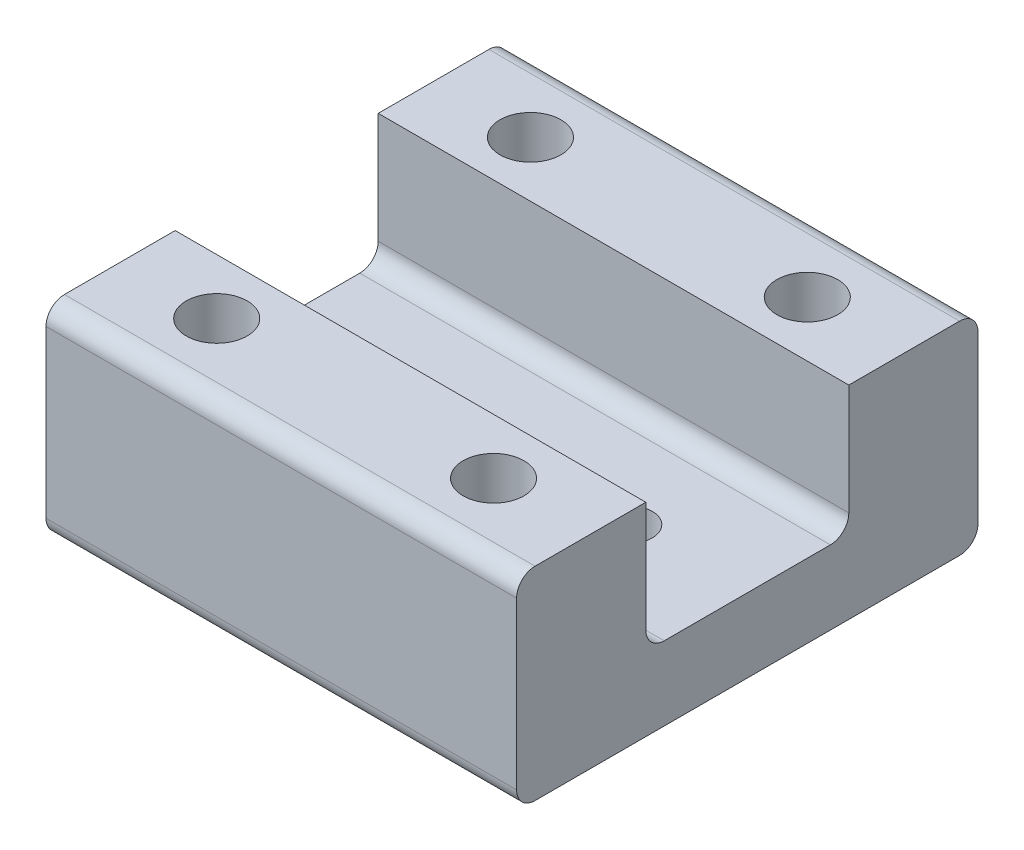
ISO-10303-21;
HEADER;
FILE_DESCRIPTION(('STEP AP214'),'2;1');
FILE_NAME('part.step','',(''),(''),'','','');
FILE_SCHEMA(('AUTOMOTIVE_DESIGN { 1 0 10303 214 1 1 1 1 }'));
ENDSEC;
DATA;
#1=APPLICATION_CONTEXT('core data for automotive mechanical design processes');
#2=APPLICATION_PROTOCOL_DEFINITION('international standard','automotive_design',2000,#1);
#3=PRODUCT_CONTEXT('',#1,'mechanical');
#4=PRODUCT('Part','Part','',(#3));
#5=PRODUCT_RELATED_PRODUCT_CATEGORY('part','',(#4));
#6=PRODUCT_DEFINITION_FORMATION('','',#4);
#7=PRODUCT_DEFINITION_CONTEXT('part definition',#1,'design');
#8=PRODUCT_DEFINITION('design','',#6,#7);
#9=PRODUCT_DEFINITION_SHAPE('','',#8);
#10=(LENGTH_UNIT() NAMED_UNIT(*) SI_UNIT(.MILLI.,.METRE.));
#11=(NAMED_UNIT(*) PLANE_ANGLE_UNIT() SI_UNIT($,.RADIAN.));
#12=(NAMED_UNIT(*) SI_UNIT($,.STERADIAN.) SOLID_ANGLE_UNIT());
#13=UNCERTAINTY_MEASURE_WITH_UNIT(LENGTH_MEASURE(1.E-05),#10,'distance_accuracy_value','');
#14=(GEOMETRIC_REPRESENTATION_CONTEXT(3) GLOBAL_UNCERTAINTY_ASSIGNED_CONTEXT((#13)) GLOBAL_UNIT_ASSIGNED_CONTEXT((#10,
#11,#12)) REPRESENTATION_CONTEXT('',''));
#15=CARTESIAN_POINT('',(0.,0.,0.));
#16=DIRECTION('',(0.,0.,1.));
#17=DIRECTION('',(1.,0.,0.));
#18=AXIS2_PLACEMENT_3D('',#15,#16,#17);
#19=CARTESIAN_POINT('',(0.,11.,0.));
#20=DIRECTION('',(0.,1.,0.));
#21=DIRECTION('',(0.,0.,1.));
#22=AXIS2_PLACEMENT_3D('',#19,#20,#21);
#23=PLANE('',#22);
#24=DIRECTION('',(0.,0.,1.));
#25=VECTOR('',#24,1.);
#26=CARTESIAN_POINT('',(-12.75,11.,12.5));
#27=LINE('',#26,#25);
#28=CARTESIAN_POINT('',(-12.75,11.,5.50000000000001));
#29=VERTEX_POINT('',#28);
#30=CARTESIAN_POINT('',(-12.75,11.,11.5));
#31=VERTEX_POINT('',#30);
#32=EDGE_CURVE('E168',#29,#31,#27,.T.);
#33=ORIENTED_EDGE('',*,*,#32,.T.);
#34=DIRECTION('',(1.,0.,0.));
#35=VECTOR('',#34,1.);
#36=CARTESIAN_POINT('',(12.75,11.,11.5));
#37=LINE('',#36,#35);
#38=CARTESIAN_POINT('',(12.75,11.,11.5));
#39=VERTEX_POINT('',#38);
#40=EDGE_CURVE('E153',#31,#39,#37,.T.);
#41=ORIENTED_EDGE('',*,*,#40,.T.);
#42=DIRECTION('',(0.,0.,-1.));
#43=VECTOR('',#42,1.);
#44=CARTESIAN_POINT('',(12.75,11.,12.5));
#45=LINE('',#44,#43);
#46=CARTESIAN_POINT('',(12.75,11.,5.5));
#47=VERTEX_POINT('',#46);
#48=EDGE_CURVE('E146',#39,#47,#45,.T.);
#49=ORIENTED_EDGE('',*,*,#48,.T.);
#50=DIRECTION('',(-1.,0.,0.));
#51=VECTOR('',#50,1.);
#52=CARTESIAN_POINT('',(12.75,11.,5.5));
#53=LINE('',#52,#51);
#54=EDGE_CURVE('E150',#47,#29,#53,.T.);
#55=ORIENTED_EDGE('',*,*,#54,.T.);
#56=EDGE_LOOP('',(#33,#41,#49,#55));
#57=FACE_BOUND('',#56,.T.);
#58=CARTESIAN_POINT('',(-7.50000000000012,11.,8.5));
#59=DIRECTION('',(0.,-1.,0.));
#60=DIRECTION('',(0.,0.,-1.));
#61=AXIS2_PLACEMENT_3D('',#58,#59,#60);
#62=CIRCLE('',#61,1.64999999999999);
#63=CARTESIAN_POINT('',(-7.50000000000012,11.,6.85000000000001));
#64=VERTEX_POINT('',#63);
#65=EDGE_CURVE('E423',#64,#64,#62,.T.);
#66=ORIENTED_EDGE('',*,*,#65,.T.);
#67=EDGE_LOOP('',(#66));
#68=FACE_BOUND('',#67,.T.);
#69=CARTESIAN_POINT('',(7.49999999999987,11.,8.5));
#70=DIRECTION('',(0.,-1.,0.));
#71=DIRECTION('',(0.,0.,-1.));
#72=AXIS2_PLACEMENT_3D('',#69,#70,#71);
#73=CIRCLE('',#72,1.64999999999999);
#74=CARTESIAN_POINT('',(7.49999999999987,11.,6.85000000000002));
#75=VERTEX_POINT('',#74);
#76=EDGE_CURVE('E431',#75,#75,#73,.T.);
#77=ORIENTED_EDGE('',*,*,#76,.T.);
#78=EDGE_LOOP('',(#77));
#79=FACE_BOUND('',#78,.T.);
#80=ADVANCED_FACE('F44',(#57,#68,#79),#23,.T.);
#81=CARTESIAN_POINT('',(0.,4.,0.));
#82=DIRECTION('',(0.,-1.,0.));
#83=DIRECTION('',(0.,0.,-1.));
#84=AXIS2_PLACEMENT_3D('',#81,#82,#83);
#85=PLANE('',#84);
#86=CARTESIAN_POINT('',(6.34999999999999,4.,0.));
#87=DIRECTION('',(0.,-1.,0.));
#88=DIRECTION('',(0.,0.,-1.));
#89=AXIS2_PLACEMENT_3D('',#86,#87,#88);
#90=CIRCLE('',#89,1.25);
#91=CARTESIAN_POINT('',(6.34999999999999,4.,-1.25));
#92=VERTEX_POINT('',#91);
#93=EDGE_CURVE('E399',#92,#92,#90,.T.);
#94=ORIENTED_EDGE('',*,*,#93,.T.);
#95=EDGE_LOOP('',(#94));
#96=FACE_BOUND('',#95,.T.);
#97=CARTESIAN_POINT('',(-6.35000000000001,4.,0.));
#98=DIRECTION('',(0.,-1.,0.));
#99=DIRECTION('',(0.,0.,-1.));
#100=AXIS2_PLACEMENT_3D('',#97,#98,#99);
#101=CIRCLE('',#100,1.25);
#102=CARTESIAN_POINT('',(-6.35000000000001,4.,-1.25));
#103=VERTEX_POINT('',#102);
#104=EDGE_CURVE('E156',#103,#103,#101,.T.);
#105=ORIENTED_EDGE('',*,*,#104,.T.);
#106=EDGE_LOOP('',(#105));
#107=FACE_BOUND('',#106,.T.);
#108=DIRECTION('',(0.,0.,-1.));
#109=VECTOR('',#108,1.);
#110=CARTESIAN_POINT('',(12.75,4.,12.5));
#111=LINE('',#110,#109);
#112=CARTESIAN_POINT('',(12.75,4.,4.5));
#113=VERTEX_POINT('',#112);
#114=CARTESIAN_POINT('',(12.75,4.,-4.5));
#115=VERTEX_POINT('',#114);
#116=EDGE_CURVE('E201',#113,#115,#111,.T.);
#117=ORIENTED_EDGE('',*,*,#116,.T.);
#118=DIRECTION('',(1.,0.,0.));
#119=VECTOR('',#118,1.);
#120=CARTESIAN_POINT('',(-12.75,4.,-4.5));
#121=LINE('',#120,#119);
#122=CARTESIAN_POINT('',(-12.75,4.,-4.50000000000001));
#123=VERTEX_POINT('',#122);
#124=EDGE_CURVE('E276',#115,#123,#121,.F.);
#125=ORIENTED_EDGE('',*,*,#124,.T.);
#126=DIRECTION('',(0.,0.,1.));
#127=VECTOR('',#126,1.);
#128=CARTESIAN_POINT('',(-12.75,4.,12.5));
#129=LINE('',#128,#127);
#130=CARTESIAN_POINT('',(-12.75,4.,4.50000000000001));
#131=VERTEX_POINT('',#130);
#132=EDGE_CURVE('E205',#123,#131,#129,.T.);
#133=ORIENTED_EDGE('',*,*,#132,.T.);
#134=DIRECTION('',(-1.,0.,0.));
#135=VECTOR('',#134,1.);
#136=CARTESIAN_POINT('',(12.75,4.,4.5));
#137=LINE('',#136,#135);
#138=EDGE_CURVE('E273',#131,#113,#137,.F.);
#139=ORIENTED_EDGE('',*,*,#138,.T.);
#140=EDGE_LOOP('',(#117,#125,#133,#139));
#141=FACE_BOUND('',#140,.T.);
#142=ADVANCED_FACE('F305',(#96,#107,#141),#85,.F.);
#143=CARTESIAN_POINT('',(12.75,4.,12.5));
#144=DIRECTION('',(-1.,0.,0.));
#145=DIRECTION('',(0.,0.,1.));
#146=AXIS2_PLACEMENT_3D('',#143,#144,#145);
#147=PLANE('',#146);
#148=DIRECTION('',(0.,0.,-1.));
#149=VECTOR('',#148,1.);
#150=CARTESIAN_POINT('',(12.75,0.,12.5));
#151=LINE('',#150,#149);
#152=CARTESIAN_POINT('',(12.75,0.,11.5));
#153=VERTEX_POINT('',#152);
#154=CARTESIAN_POINT('',(12.75,0.,-11.5));
#155=VERTEX_POINT('',#154);
#156=EDGE_CURVE('E200',#153,#155,#151,.T.);
#157=ORIENTED_EDGE('',*,*,#156,.T.);
#158=CARTESIAN_POINT('',(12.75,1.,-11.5));
#159=DIRECTION('',(-1.,0.,0.));
#160=DIRECTION('',(0.,0.,1.));
#161=AXIS2_PLACEMENT_3D('',#158,#159,#160);
#162=CIRCLE('',#161,1.);
#163=CARTESIAN_POINT('',(12.75,1.,-12.5));
#164=VERTEX_POINT('',#163);
#165=EDGE_CURVE('E262',#155,#164,#162,.F.);
#166=ORIENTED_EDGE('',*,*,#165,.T.);
#167=DIRECTION('',(0.,-1.,0.));
#168=VECTOR('',#167,1.);
#169=CARTESIAN_POINT('',(12.75,4.,-12.5));
#170=LINE('',#169,#168);
#171=CARTESIAN_POINT('',(12.75,10.,-12.5));
#172=VERTEX_POINT('',#171);
#173=EDGE_CURVE('E226',#172,#164,#170,.T.);
#174=ORIENTED_EDGE('',*,*,#173,.F.);
#175=CARTESIAN_POINT('',(12.75,10.,-11.5));
#176=DIRECTION('',(-1.,0.,0.));
#177=DIRECTION('',(0.,0.,1.));
#178=AXIS2_PLACEMENT_3D('',#175,#176,#177);
#179=CIRCLE('',#178,1.);
#180=CARTESIAN_POINT('',(12.75,11.,-11.5));
#181=VERTEX_POINT('',#180);
#182=EDGE_CURVE('E259',#172,#181,#179,.F.);
#183=ORIENTED_EDGE('',*,*,#182,.T.);
#184=DIRECTION('',(0.,0.,-1.));
#185=VECTOR('',#184,1.);
#186=CARTESIAN_POINT('',(12.75,11.,-12.5));
#187=LINE('',#186,#185);
#188=CARTESIAN_POINT('',(12.75,11.,-5.5));
#189=VERTEX_POINT('',#188);
#190=EDGE_CURVE('E175',#189,#181,#187,.T.);
#191=ORIENTED_EDGE('',*,*,#190,.F.);
#192=DIRECTION('',(0.,-1.,0.));
#193=VECTOR('',#192,1.);
#194=CARTESIAN_POINT('',(12.75,11.,-5.5));
#195=LINE('',#194,#193);
#196=CARTESIAN_POINT('',(12.75,5.,-5.5));
#197=VERTEX_POINT('',#196);
#198=EDGE_CURVE('E192',#189,#197,#195,.T.);
#199=ORIENTED_EDGE('',*,*,#198,.T.);
#200=CARTESIAN_POINT('',(12.75,5.,-4.5));
#201=DIRECTION('',(-1.,0.,0.));
#202=DIRECTION('',(0.,0.,1.));
#203=AXIS2_PLACEMENT_3D('',#200,#201,#202);
#204=CIRCLE('',#203,1.);
#205=EDGE_CURVE('E290',#197,#115,#204,.T.);
#206=ORIENTED_EDGE('',*,*,#205,.T.);
#207=ORIENTED_EDGE('',*,*,#116,.F.);
#208=CARTESIAN_POINT('',(12.75,5.,4.5));
#209=DIRECTION('',(-1.,0.,0.));
#210=DIRECTION('',(0.,0.,1.));
#211=AXIS2_PLACEMENT_3D('',#208,#209,#210);
#212=CIRCLE('',#211,1.);
#213=CARTESIAN_POINT('',(12.75,5.,5.5));
#214=VERTEX_POINT('',#213);
#215=EDGE_CURVE('E11',#113,#214,#212,.T.);
#216=ORIENTED_EDGE('',*,*,#215,.T.);
#217=DIRECTION('',(0.,-1.,0.));
#218=VECTOR('',#217,1.);
#219=CARTESIAN_POINT('',(12.75,11.,5.5));
#220=LINE('',#219,#218);
#221=EDGE_CURVE('E162',#47,#214,#220,.T.);
#222=ORIENTED_EDGE('',*,*,#221,.F.);
#223=ORIENTED_EDGE('',*,*,#48,.F.);
#224=CARTESIAN_POINT('',(12.75,10.,11.5));
#225=DIRECTION('',(-1.,0.,0.));
#226=DIRECTION('',(0.,0.,1.));
#227=AXIS2_PLACEMENT_3D('',#224,#225,#226);
#228=CIRCLE('',#227,1.);
#229=CARTESIAN_POINT('',(12.75,10.,12.5));
#230=VERTEX_POINT('',#229);
#231=EDGE_CURVE('E68',#39,#230,#228,.F.);
#232=ORIENTED_EDGE('',*,*,#231,.T.);
#233=DIRECTION('',(0.,-1.,0.));
#234=VECTOR('',#233,1.);
#235=CARTESIAN_POINT('',(12.75,4.,12.5));
#236=LINE('',#235,#234);
#237=CARTESIAN_POINT('',(12.75,1.,12.5));
#238=VERTEX_POINT('',#237);
#239=EDGE_CURVE('E210',#230,#238,#236,.T.);
#240=ORIENTED_EDGE('',*,*,#239,.T.);
#241=CARTESIAN_POINT('',(12.75,1.,11.5));
#242=DIRECTION('',(-1.,0.,0.));
#243=DIRECTION('',(0.,0.,1.));
#244=AXIS2_PLACEMENT_3D('',#241,#242,#243);
#245=CIRCLE('',#244,1.);
#246=EDGE_CURVE('E60',#238,#153,#245,.F.);
#247=ORIENTED_EDGE('',*,*,#246,.T.);
#248=EDGE_LOOP('',(#157,#166,#174,#183,#191,#199,#206,#207,#216,#222,#223,#232,#240,#247));
#249=FACE_BOUND('',#248,.T.);
#250=ADVANCED_FACE('F171',(#249),#147,.F.);
#251=CARTESIAN_POINT('',(-12.75,4.,-12.5));
#252=DIRECTION('',(0.,0.,1.));
#253=DIRECTION('',(1.,0.,0.));
#254=AXIS2_PLACEMENT_3D('',#251,#252,#253);
#255=PLANE('',#254);
#256=ORIENTED_EDGE('',*,*,#173,.T.);
#257=DIRECTION('',(-1.,0.,0.));
#258=VECTOR('',#257,1.);
#259=CARTESIAN_POINT('',(-12.75,1.,-12.5));
#260=LINE('',#259,#258);
#261=CARTESIAN_POINT('',(-12.75,1.,-12.5));
#262=VERTEX_POINT('',#261);
#263=EDGE_CURVE('E233',#164,#262,#260,.T.);
#264=ORIENTED_EDGE('',*,*,#263,.T.);
#265=DIRECTION('',(0.,-1.,0.));
#266=VECTOR('',#265,1.);
#267=CARTESIAN_POINT('',(-12.75,4.,-12.5));
#268=LINE('',#267,#266);
#269=CARTESIAN_POINT('',(-12.75,10.,-12.5));
#270=VERTEX_POINT('',#269);
#271=EDGE_CURVE('E222',#270,#262,#268,.T.);
#272=ORIENTED_EDGE('',*,*,#271,.F.);
#273=DIRECTION('',(-1.,0.,0.));
#274=VECTOR('',#273,1.);
#275=CARTESIAN_POINT('',(-12.75,10.,-12.5));
#276=LINE('',#275,#274);
#277=EDGE_CURVE('E230',#270,#172,#276,.F.);
#278=ORIENTED_EDGE('',*,*,#277,.T.);
#279=EDGE_LOOP('',(#256,#264,#272,#278));
#280=FACE_BOUND('',#279,.T.);
#281=ADVANCED_FACE('F351',(#280),#255,.F.);
#282=CARTESIAN_POINT('',(-12.75,4.,12.5));
#283=DIRECTION('',(1.,0.,0.));
#284=DIRECTION('',(0.,0.,-1.));
#285=AXIS2_PLACEMENT_3D('',#282,#283,#284);
#286=PLANE('',#285);
#287=ORIENTED_EDGE('',*,*,#271,.T.);
#288=CARTESIAN_POINT('',(-12.75,1.,-11.5));
#289=DIRECTION('',(1.,0.,0.));
#290=DIRECTION('',(0.,0.,-1.));
#291=AXIS2_PLACEMENT_3D('',#288,#289,#290);
#292=CIRCLE('',#291,1.);
#293=CARTESIAN_POINT('',(-12.75,0.,-11.5));
#294=VERTEX_POINT('',#293);
#295=EDGE_CURVE('E246',#262,#294,#292,.F.);
#296=ORIENTED_EDGE('',*,*,#295,.T.);
#297=DIRECTION('',(0.,0.,1.));
#298=VECTOR('',#297,1.);
#299=CARTESIAN_POINT('',(-12.75,0.,12.5));
#300=LINE('',#299,#298);
#301=CARTESIAN_POINT('',(-12.75,0.,11.5));
#302=VERTEX_POINT('',#301);
#303=EDGE_CURVE('E206',#294,#302,#300,.T.);
#304=ORIENTED_EDGE('',*,*,#303,.T.);
#305=CARTESIAN_POINT('',(-12.75,1.,11.5));
#306=DIRECTION('',(1.,0.,0.));
#307=DIRECTION('',(0.,0.,-1.));
#308=AXIS2_PLACEMENT_3D('',#305,#306,#307);
#309=CIRCLE('',#308,1.);
#310=CARTESIAN_POINT('',(-12.75,1.,12.5));
#311=VERTEX_POINT('',#310);
#312=EDGE_CURVE('E237',#302,#311,#309,.F.);
#313=ORIENTED_EDGE('',*,*,#312,.T.);
#314=DIRECTION('',(0.,-1.,0.));
#315=VECTOR('',#314,1.);
#316=CARTESIAN_POINT('',(-12.75,4.,12.5));
#317=LINE('',#316,#315);
#318=CARTESIAN_POINT('',(-12.75,10.,12.5));
#319=VERTEX_POINT('',#318);
#320=EDGE_CURVE('E218',#319,#311,#317,.T.);
#321=ORIENTED_EDGE('',*,*,#320,.F.);
#322=CARTESIAN_POINT('',(-12.75,10.,11.5));
#323=DIRECTION('',(1.,0.,0.));
#324=DIRECTION('',(0.,0.,-1.));
#325=AXIS2_PLACEMENT_3D('',#322,#323,#324);
#326=CIRCLE('',#325,1.);
#327=EDGE_CURVE('E240',#319,#31,#326,.F.);
#328=ORIENTED_EDGE('',*,*,#327,.T.);
#329=ORIENTED_EDGE('',*,*,#32,.F.);
#330=DIRECTION('',(0.,-1.,0.));
#331=VECTOR('',#330,1.);
#332=CARTESIAN_POINT('',(-12.75,11.,5.50000000000001));
#333=LINE('',#332,#331);
#334=CARTESIAN_POINT('',(-12.75,5.,5.50000000000001));
#335=VERTEX_POINT('',#334);
#336=EDGE_CURVE('E165',#29,#335,#333,.T.);
#337=ORIENTED_EDGE('',*,*,#336,.T.);
#338=CARTESIAN_POINT('',(-12.75,5.,4.5));
#339=DIRECTION('',(1.,0.,0.));
#340=DIRECTION('',(0.,0.,-1.));
#341=AXIS2_PLACEMENT_3D('',#338,#339,#340);
#342=CIRCLE('',#341,1.);
#343=EDGE_CURVE('E53',#335,#131,#342,.T.);
#344=ORIENTED_EDGE('',*,*,#343,.T.);
#345=ORIENTED_EDGE('',*,*,#132,.F.);
#346=CARTESIAN_POINT('',(-12.75,5.,-4.5));
#347=DIRECTION('',(1.,0.,0.));
#348=DIRECTION('',(0.,0.,-1.));
#349=AXIS2_PLACEMENT_3D('',#346,#347,#348);
#350=CIRCLE('',#349,1.);
#351=CARTESIAN_POINT('',(-12.75,5.,-5.50000000000001));
#352=VERTEX_POINT('',#351);
#353=EDGE_CURVE('E293',#123,#352,#350,.T.);
#354=ORIENTED_EDGE('',*,*,#353,.T.);
#355=DIRECTION('',(0.,-1.,0.));
#356=VECTOR('',#355,1.);
#357=CARTESIAN_POINT('',(-12.75,11.,-5.50000000000001));
#358=LINE('',#357,#356);
#359=CARTESIAN_POINT('',(-12.75,11.,-5.50000000000001));
#360=VERTEX_POINT('',#359);
#361=EDGE_CURVE('E196',#360,#352,#358,.T.);
#362=ORIENTED_EDGE('',*,*,#361,.F.);
#363=DIRECTION('',(0.,0.,1.));
#364=VECTOR('',#363,1.);
#365=CARTESIAN_POINT('',(-12.75,11.,-12.5));
#366=LINE('',#365,#364);
#367=CARTESIAN_POINT('',(-12.75,11.,-11.5));
#368=VERTEX_POINT('',#367);
#369=EDGE_CURVE('E182',#368,#360,#366,.T.);
#370=ORIENTED_EDGE('',*,*,#369,.F.);
#371=CARTESIAN_POINT('',(-12.75,10.,-11.5));
#372=DIRECTION('',(1.,0.,0.));
#373=DIRECTION('',(0.,0.,-1.));
#374=AXIS2_PLACEMENT_3D('',#371,#372,#373);
#375=CIRCLE('',#374,1.);
#376=EDGE_CURVE('E243',#368,#270,#375,.F.);
#377=ORIENTED_EDGE('',*,*,#376,.T.);
#378=EDGE_LOOP('',(#287,#296,#304,#313,#321,#328,#329,#337,#344,#345,#354,#362,#370,#377));
#379=FACE_BOUND('',#378,.T.);
#380=ADVANCED_FACE('F300',(#379),#286,.F.);
#381=CARTESIAN_POINT('',(-12.75,4.,12.5));
#382=DIRECTION('',(0.,0.,-1.));
#383=DIRECTION('',(-1.,0.,0.));
#384=AXIS2_PLACEMENT_3D('',#381,#382,#383);
#385=PLANE('',#384);
#386=ORIENTED_EDGE('',*,*,#239,.F.);
#387=DIRECTION('',(1.,0.,0.));
#388=VECTOR('',#387,1.);
#389=CARTESIAN_POINT('',(-12.75,10.,12.5));
#390=LINE('',#389,#388);
#391=EDGE_CURVE('E287',#230,#319,#390,.F.);
#392=ORIENTED_EDGE('',*,*,#391,.T.);
#393=ORIENTED_EDGE('',*,*,#320,.T.);
#394=DIRECTION('',(1.,0.,0.));
#395=VECTOR('',#394,1.);
#396=CARTESIAN_POINT('',(12.75,1.,12.5));
#397=LINE('',#396,#395);
#398=EDGE_CURVE('E284',#311,#238,#397,.T.);
#399=ORIENTED_EDGE('',*,*,#398,.T.);
#400=EDGE_LOOP('',(#386,#392,#393,#399));
#401=FACE_BOUND('',#400,.T.);
#402=ADVANCED_FACE('F344',(#401),#385,.F.);
#403=CARTESIAN_POINT('',(0.,0.,0.));
#404=DIRECTION('',(0.,-1.,0.));
#405=DIRECTION('',(0.,0.,-1.));
#406=AXIS2_PLACEMENT_3D('',#403,#404,#405);
#407=PLANE('',#406);
#408=CARTESIAN_POINT('',(7.49999999999987,0.,8.5));
#409=DIRECTION('',(0.,-1.,0.));
#410=DIRECTION('',(0.,0.,-1.));
#411=AXIS2_PLACEMENT_3D('',#408,#409,#410);
#412=CIRCLE('',#411,1.64999999999999);
#413=CARTESIAN_POINT('',(7.49999999999987,0.,6.85000000000001));
#414=VERTEX_POINT('',#413);
#415=EDGE_CURVE('E435',#414,#414,#412,.T.);
#416=ORIENTED_EDGE('',*,*,#415,.F.);
#417=EDGE_LOOP('',(#416));
#418=FACE_BOUND('',#417,.T.);
#419=CARTESIAN_POINT('',(-7.50000000000012,0.,8.5));
#420=DIRECTION('',(0.,-1.,0.));
#421=DIRECTION('',(0.,0.,-1.));
#422=AXIS2_PLACEMENT_3D('',#419,#420,#421);
#423=CIRCLE('',#422,1.64999999999999);
#424=CARTESIAN_POINT('',(-7.50000000000012,0.,6.85000000000001));
#425=VERTEX_POINT('',#424);
#426=EDGE_CURVE('E427',#425,#425,#423,.T.);
#427=ORIENTED_EDGE('',*,*,#426,.F.);
#428=EDGE_LOOP('',(#427));
#429=FACE_BOUND('',#428,.T.);
#430=CARTESIAN_POINT('',(-7.50000000000012,0.,-8.5));
#431=DIRECTION('',(0.,-1.,0.));
#432=DIRECTION('',(0.,0.,-1.));
#433=AXIS2_PLACEMENT_3D('',#430,#431,#432);
#434=CIRCLE('',#433,1.64999999999999);
#435=CARTESIAN_POINT('',(-7.50000000000012,0.,-10.15));
#436=VERTEX_POINT('',#435);
#437=EDGE_CURVE('E419',#436,#436,#434,.T.);
#438=ORIENTED_EDGE('',*,*,#437,.F.);
#439=EDGE_LOOP('',(#438));
#440=FACE_BOUND('',#439,.T.);
#441=CARTESIAN_POINT('',(7.49999999999988,0.,-8.5));
#442=DIRECTION('',(0.,-1.,0.));
#443=DIRECTION('',(0.,0.,-1.));
#444=AXIS2_PLACEMENT_3D('',#441,#442,#443);
#445=CIRCLE('',#444,1.64999999999999);
#446=CARTESIAN_POINT('',(7.49999999999988,0.,-10.15));
#447=VERTEX_POINT('',#446);
#448=EDGE_CURVE('E411',#447,#447,#445,.T.);
#449=ORIENTED_EDGE('',*,*,#448,.F.);
#450=EDGE_LOOP('',(#449));
#451=FACE_BOUND('',#450,.T.);
#452=CARTESIAN_POINT('',(6.34999999999999,0.,0.));
#453=DIRECTION('',(0.,-1.,0.));
#454=DIRECTION('',(0.,0.,-1.));
#455=AXIS2_PLACEMENT_3D('',#452,#453,#454);
#456=CIRCLE('',#455,1.25);
#457=CARTESIAN_POINT('',(6.34999999999999,0.,-1.25));
#458=VERTEX_POINT('',#457);
#459=EDGE_CURVE('E403',#458,#458,#456,.T.);
#460=ORIENTED_EDGE('',*,*,#459,.F.);
#461=EDGE_LOOP('',(#460));
#462=FACE_BOUND('',#461,.T.);
#463=CARTESIAN_POINT('',(-6.35000000000001,0.,0.));
#464=DIRECTION('',(0.,-1.,0.));
#465=DIRECTION('',(0.,0.,-1.));
#466=AXIS2_PLACEMENT_3D('',#463,#464,#465);
#467=CIRCLE('',#466,1.25);
#468=CARTESIAN_POINT('',(-6.35000000000001,0.,-1.25));
#469=VERTEX_POINT('',#468);
#470=EDGE_CURVE('E395',#469,#469,#467,.T.);
#471=ORIENTED_EDGE('',*,*,#470,.F.);
#472=EDGE_LOOP('',(#471));
#473=FACE_BOUND('',#472,.T.);
#474=ORIENTED_EDGE('',*,*,#303,.F.);
#475=DIRECTION('',(-1.,0.,0.));
#476=VECTOR('',#475,1.);
#477=CARTESIAN_POINT('',(12.75,0.,-11.5));
#478=LINE('',#477,#476);
#479=EDGE_CURVE('E252',#294,#155,#478,.F.);
#480=ORIENTED_EDGE('',*,*,#479,.T.);
#481=ORIENTED_EDGE('',*,*,#156,.F.);
#482=DIRECTION('',(1.,0.,0.));
#483=VECTOR('',#482,1.);
#484=CARTESIAN_POINT('',(-12.75,0.,11.5));
#485=LINE('',#484,#483);
#486=EDGE_CURVE('E249',#153,#302,#485,.F.);
#487=ORIENTED_EDGE('',*,*,#486,.T.);
#488=EDGE_LOOP('',(#474,#480,#481,#487));
#489=FACE_BOUND('',#488,.T.);
#490=ADVANCED_FACE('F339',(#418,#429,#440,#451,#462,#473,#489),#407,.T.);
#491=CARTESIAN_POINT('',(12.75,11.,-5.5));
#492=DIRECTION('',(0.,0.,-1.));
#493=DIRECTION('',(-1.,0.,0.));
#494=AXIS2_PLACEMENT_3D('',#491,#492,#493);
#495=PLANE('',#494);
#496=ORIENTED_EDGE('',*,*,#361,.T.);
#497=DIRECTION('',(1.,0.,0.));
#498=VECTOR('',#497,1.);
#499=CARTESIAN_POINT('',(12.75,5.,-5.5));
#500=LINE('',#499,#498);
#501=EDGE_CURVE('E269',#352,#197,#500,.T.);
#502=ORIENTED_EDGE('',*,*,#501,.T.);
#503=ORIENTED_EDGE('',*,*,#198,.F.);
#504=DIRECTION('',(1.,0.,0.));
#505=VECTOR('',#504,1.);
#506=CARTESIAN_POINT('',(12.75,11.,-5.5));
#507=LINE('',#506,#505);
#508=EDGE_CURVE('E189',#360,#189,#507,.T.);
#509=ORIENTED_EDGE('',*,*,#508,.F.);
#510=EDGE_LOOP('',(#496,#502,#503,#509));
#511=FACE_BOUND('',#510,.T.);
#512=ADVANCED_FACE('F336',(#511),#495,.F.);
#513=CARTESIAN_POINT('',(0.,11.,0.));
#514=DIRECTION('',(0.,-1.,0.));
#515=DIRECTION('',(0.,0.,-1.));
#516=AXIS2_PLACEMENT_3D('',#513,#514,#515);
#517=PLANE('',#516);
#518=CARTESIAN_POINT('',(-7.50000000000012,11.,-8.5));
#519=DIRECTION('',(0.,-1.,0.));
#520=DIRECTION('',(0.,0.,-1.));
#521=AXIS2_PLACEMENT_3D('',#518,#519,#520);
#522=CIRCLE('',#521,1.64999999999999);
#523=CARTESIAN_POINT('',(-7.50000000000012,11.,-10.15));
#524=VERTEX_POINT('',#523);
#525=EDGE_CURVE('E415',#524,#524,#522,.T.);
#526=ORIENTED_EDGE('',*,*,#525,.T.);
#527=EDGE_LOOP('',(#526));
#528=FACE_BOUND('',#527,.T.);
#529=CARTESIAN_POINT('',(7.49999999999988,11.,-8.5));
#530=DIRECTION('',(0.,-1.,0.));
#531=DIRECTION('',(0.,0.,-1.));
#532=AXIS2_PLACEMENT_3D('',#529,#530,#531);
#533=CIRCLE('',#532,1.64999999999999);
#534=CARTESIAN_POINT('',(7.49999999999988,11.,-10.15));
#535=VERTEX_POINT('',#534);
#536=EDGE_CURVE('E407',#535,#535,#533,.T.);
#537=ORIENTED_EDGE('',*,*,#536,.T.);
#538=EDGE_LOOP('',(#537));
#539=FACE_BOUND('',#538,.T.);
#540=ORIENTED_EDGE('',*,*,#190,.T.);
#541=DIRECTION('',(-1.,0.,0.));
#542=VECTOR('',#541,1.);
#543=CARTESIAN_POINT('',(0.,11.,-11.5));
#544=LINE('',#543,#542);
#545=EDGE_CURVE('E265',#181,#368,#544,.T.);
#546=ORIENTED_EDGE('',*,*,#545,.T.);
#547=ORIENTED_EDGE('',*,*,#369,.T.);
#548=ORIENTED_EDGE('',*,*,#508,.T.);
#549=EDGE_LOOP('',(#540,#546,#547,#548));
#550=FACE_BOUND('',#549,.T.);
#551=ADVANCED_FACE('F333',(#528,#539,#550),#517,.F.);
#552=CARTESIAN_POINT('',(12.75,11.,5.5));
#553=DIRECTION('',(0.,0.,1.));
#554=DIRECTION('',(1.,0.,0.));
#555=AXIS2_PLACEMENT_3D('',#552,#553,#554);
#556=PLANE('',#555);
#557=ORIENTED_EDGE('',*,*,#221,.T.);
#558=DIRECTION('',(-1.,0.,0.));
#559=VECTOR('',#558,1.);
#560=CARTESIAN_POINT('',(-12.75,5.,5.50000000000001));
#561=LINE('',#560,#559);
#562=EDGE_CURVE('E279',#214,#335,#561,.T.);
#563=ORIENTED_EDGE('',*,*,#562,.T.);
#564=ORIENTED_EDGE('',*,*,#336,.F.);
#565=ORIENTED_EDGE('',*,*,#54,.F.);
#566=EDGE_LOOP('',(#557,#563,#564,#565));
#567=FACE_BOUND('',#566,.T.);
#568=ADVANCED_FACE('F160',(#567),#556,.F.);
#569=CARTESIAN_POINT('',(-6.35000000000001,0.,0.));
#570=DIRECTION('',(0.,-1.,0.));
#571=DIRECTION('',(0.,0.,-1.));
#572=AXIS2_PLACEMENT_3D('',#569,#570,#571);
#573=CYLINDRICAL_SURFACE('',#572,1.25);
#574=ORIENTED_EDGE('',*,*,#470,.T.);
#575=EDGE_LOOP('',(#574));
#576=FACE_BOUND('',#575,.T.);
#577=ORIENTED_EDGE('',*,*,#104,.F.);
#578=EDGE_LOOP('',(#577));
#579=FACE_BOUND('',#578,.T.);
#580=ADVANCED_FACE('F329',(#576,#579),#573,.F.);
#581=CARTESIAN_POINT('',(6.34999999999999,0.,0.));
#582=DIRECTION('',(0.,-1.,0.));
#583=DIRECTION('',(0.,0.,-1.));
#584=AXIS2_PLACEMENT_3D('',#581,#582,#583);
#585=CYLINDRICAL_SURFACE('',#584,1.25);
#586=ORIENTED_EDGE('',*,*,#459,.T.);
#587=EDGE_LOOP('',(#586));
#588=FACE_BOUND('',#587,.T.);
#589=ORIENTED_EDGE('',*,*,#93,.F.);
#590=EDGE_LOOP('',(#589));
#591=FACE_BOUND('',#590,.T.);
#592=ADVANCED_FACE('F455',(#588,#591),#585,.F.);
#593=CARTESIAN_POINT('',(7.49999999999988,0.,-8.5));
#594=DIRECTION('',(0.,-1.,0.));
#595=DIRECTION('',(0.,0.,-1.));
#596=AXIS2_PLACEMENT_3D('',#593,#594,#595);
#597=CYLINDRICAL_SURFACE('',#596,1.64999999999999);
#598=ORIENTED_EDGE('',*,*,#536,.F.);
#599=EDGE_LOOP('',(#598));
#600=FACE_BOUND('',#599,.T.);
#601=ORIENTED_EDGE('',*,*,#448,.T.);
#602=EDGE_LOOP('',(#601));
#603=FACE_BOUND('',#602,.T.);
#604=ADVANCED_FACE('F461',(#600,#603),#597,.F.);
#605=CARTESIAN_POINT('',(-7.50000000000012,0.,-8.5));
#606=DIRECTION('',(0.,-1.,0.));
#607=DIRECTION('',(0.,0.,-1.));
#608=AXIS2_PLACEMENT_3D('',#605,#606,#607);
#609=CYLINDRICAL_SURFACE('',#608,1.64999999999999);
#610=ORIENTED_EDGE('',*,*,#525,.F.);
#611=EDGE_LOOP('',(#610));
#612=FACE_BOUND('',#611,.T.);
#613=ORIENTED_EDGE('',*,*,#437,.T.);
#614=EDGE_LOOP('',(#613));
#615=FACE_BOUND('',#614,.T.);
#616=ADVANCED_FACE('F466',(#612,#615),#609,.F.);
#617=CARTESIAN_POINT('',(-7.50000000000012,0.,8.5));
#618=DIRECTION('',(0.,-1.,0.));
#619=DIRECTION('',(0.,0.,-1.));
#620=AXIS2_PLACEMENT_3D('',#617,#618,#619);
#621=CYLINDRICAL_SURFACE('',#620,1.64999999999999);
#622=ORIENTED_EDGE('',*,*,#65,.F.);
#623=EDGE_LOOP('',(#622));
#624=FACE_BOUND('',#623,.T.);
#625=ORIENTED_EDGE('',*,*,#426,.T.);
#626=EDGE_LOOP('',(#625));
#627=FACE_BOUND('',#626,.T.);
#628=ADVANCED_FACE('F473',(#624,#627),#621,.F.);
#629=CARTESIAN_POINT('',(7.49999999999987,0.,8.5));
#630=DIRECTION('',(0.,-1.,0.));
#631=DIRECTION('',(0.,0.,-1.));
#632=AXIS2_PLACEMENT_3D('',#629,#630,#631);
#633=CYLINDRICAL_SURFACE('',#632,1.64999999999999);
#634=ORIENTED_EDGE('',*,*,#76,.F.);
#635=EDGE_LOOP('',(#634));
#636=FACE_BOUND('',#635,.T.);
#637=ORIENTED_EDGE('',*,*,#415,.T.);
#638=EDGE_LOOP('',(#637));
#639=FACE_BOUND('',#638,.T.);
#640=ADVANCED_FACE('F360',(#636,#639),#633,.F.);
#641=CARTESIAN_POINT('',(-12.75,1.,-11.5));
#642=DIRECTION('',(1.,0.,0.));
#643=DIRECTION('',(0.,0.,-1.));
#644=AXIS2_PLACEMENT_3D('',#641,#642,#643);
#645=CYLINDRICAL_SURFACE('',#644,1.);
#646=ORIENTED_EDGE('',*,*,#165,.F.);
#647=ORIENTED_EDGE('',*,*,#479,.F.);
#648=ORIENTED_EDGE('',*,*,#295,.F.);
#649=ORIENTED_EDGE('',*,*,#263,.F.);
#650=EDGE_LOOP('',(#646,#647,#648,#649));
#651=FACE_BOUND('',#650,.T.);
#652=ADVANCED_FACE('F357',(#651),#645,.T.);
#653=CARTESIAN_POINT('',(0.,10.,-11.5));
#654=DIRECTION('',(-1.,0.,0.));
#655=DIRECTION('',(0.,0.,1.));
#656=AXIS2_PLACEMENT_3D('',#653,#654,#655);
#657=CYLINDRICAL_SURFACE('',#656,1.);
#658=ORIENTED_EDGE('',*,*,#182,.F.);
#659=ORIENTED_EDGE('',*,*,#277,.F.);
#660=ORIENTED_EDGE('',*,*,#376,.F.);
#661=ORIENTED_EDGE('',*,*,#545,.F.);
#662=EDGE_LOOP('',(#658,#659,#660,#661));
#663=FACE_BOUND('',#662,.T.);
#664=ADVANCED_FACE('F317',(#663),#657,.T.);
#665=CARTESIAN_POINT('',(12.75,5.,-4.5));
#666=DIRECTION('',(-1.,0.,0.));
#667=DIRECTION('',(0.,0.,1.));
#668=AXIS2_PLACEMENT_3D('',#665,#666,#667);
#669=CYLINDRICAL_SURFACE('',#668,1.);
#670=ORIENTED_EDGE('',*,*,#353,.F.);
#671=ORIENTED_EDGE('',*,*,#124,.F.);
#672=ORIENTED_EDGE('',*,*,#205,.F.);
#673=ORIENTED_EDGE('',*,*,#501,.F.);
#674=EDGE_LOOP('',(#670,#671,#672,#673));
#675=FACE_BOUND('',#674,.T.);
#676=ADVANCED_FACE('F310',(#675),#669,.F.);
#677=CARTESIAN_POINT('',(12.75,5.,4.5));
#678=DIRECTION('',(1.,0.,0.));
#679=DIRECTION('',(0.,0.,-1.));
#680=AXIS2_PLACEMENT_3D('',#677,#678,#679);
#681=CYLINDRICAL_SURFACE('',#680,1.);
#682=ORIENTED_EDGE('',*,*,#215,.F.);
#683=ORIENTED_EDGE('',*,*,#138,.F.);
#684=ORIENTED_EDGE('',*,*,#343,.F.);
#685=ORIENTED_EDGE('',*,*,#562,.F.);
#686=EDGE_LOOP('',(#682,#683,#684,#685));
#687=FACE_BOUND('',#686,.T.);
#688=ADVANCED_FACE('F307',(#687),#681,.F.);
#689=CARTESIAN_POINT('',(0.,10.,11.5));
#690=DIRECTION('',(-1.,0.,0.));
#691=DIRECTION('',(0.,0.,1.));
#692=AXIS2_PLACEMENT_3D('',#689,#690,#691);
#693=CYLINDRICAL_SURFACE('',#692,1.);
#694=ORIENTED_EDGE('',*,*,#327,.F.);
#695=ORIENTED_EDGE('',*,*,#391,.F.);
#696=ORIENTED_EDGE('',*,*,#231,.F.);
#697=ORIENTED_EDGE('',*,*,#40,.F.);
#698=EDGE_LOOP('',(#694,#695,#696,#697));
#699=FACE_BOUND('',#698,.T.);
#700=ADVANCED_FACE('F309',(#699),#693,.T.);
#701=CARTESIAN_POINT('',(-12.75,1.,11.5));
#702=DIRECTION('',(-1.,0.,0.));
#703=DIRECTION('',(0.,0.,1.));
#704=AXIS2_PLACEMENT_3D('',#701,#702,#703);
#705=CYLINDRICAL_SURFACE('',#704,1.);
#706=ORIENTED_EDGE('',*,*,#312,.F.);
#707=ORIENTED_EDGE('',*,*,#486,.F.);
#708=ORIENTED_EDGE('',*,*,#246,.F.);
#709=ORIENTED_EDGE('',*,*,#398,.F.);
#710=EDGE_LOOP('',(#706,#707,#708,#709));
#711=FACE_BOUND('',#710,.T.);
#712=ADVANCED_FACE('F46',(#711),#705,.T.);
#713=CLOSED_SHELL('',(#80,#142,#250,#281,#380,#402,#490,#512,#551,#568,#580,#592,#604,#616,#628,
#640,#652,#664,#676,#688,#700,#712));
#714=MANIFOLD_SOLID_BREP('B2',#713);
#715=ADVANCED_BREP_SHAPE_REPRESENTATION('',(#18,#714),#14);
#716=SHAPE_DEFINITION_REPRESENTATION(#9,#715);
ENDSEC;
END-ISO-10303-21;
